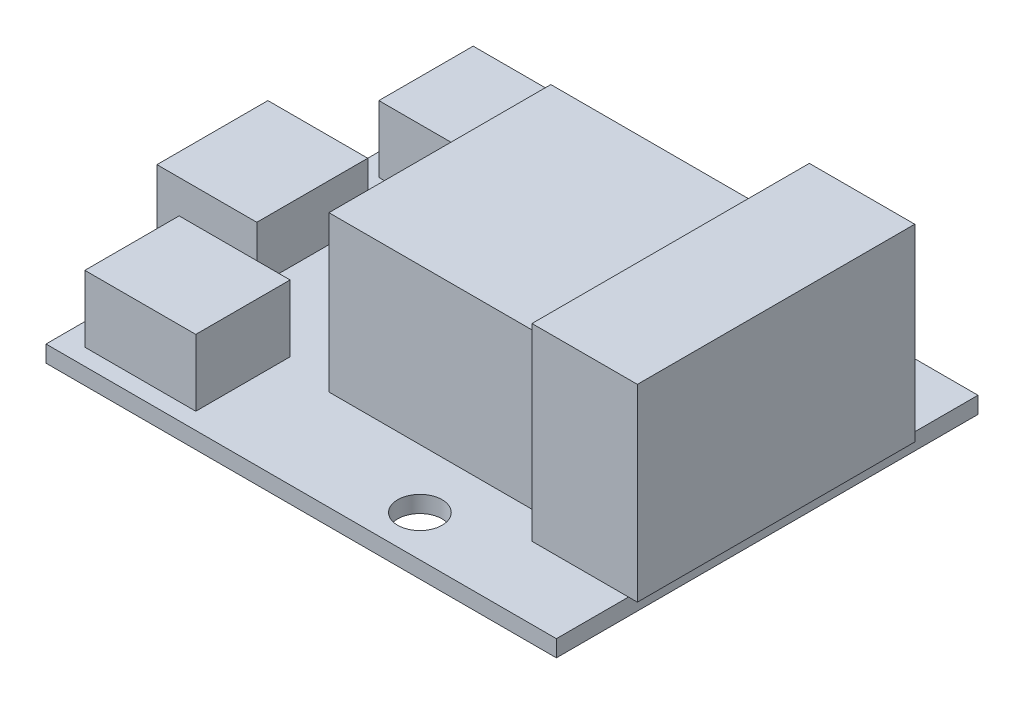
ISO-10303-21;
HEADER;
FILE_DESCRIPTION(('STEP AP214'),'2;1');
FILE_NAME('part.step','',(''),(''),'','','');
FILE_SCHEMA(('AUTOMOTIVE_DESIGN { 1 0 10303 214 1 1 1 1 }'));
ENDSEC;
DATA;
#1=APPLICATION_CONTEXT('core data for automotive mechanical design processes');
#2=APPLICATION_PROTOCOL_DEFINITION('international standard','automotive_design',2000,#1);
#3=PRODUCT_CONTEXT('',#1,'mechanical');
#4=PRODUCT('Part','Part','',(#3));
#5=PRODUCT_RELATED_PRODUCT_CATEGORY('part','',(#4));
#6=PRODUCT_DEFINITION_FORMATION('','',#4);
#7=PRODUCT_DEFINITION_CONTEXT('part definition',#1,'design');
#8=PRODUCT_DEFINITION('design','',#6,#7);
#9=PRODUCT_DEFINITION_SHAPE('','',#8);
#10=(LENGTH_UNIT() NAMED_UNIT(*) SI_UNIT(.MILLI.,.METRE.));
#11=(NAMED_UNIT(*) PLANE_ANGLE_UNIT() SI_UNIT($,.RADIAN.));
#12=(NAMED_UNIT(*) SI_UNIT($,.STERADIAN.) SOLID_ANGLE_UNIT());
#13=UNCERTAINTY_MEASURE_WITH_UNIT(LENGTH_MEASURE(1.E-05),#10,'distance_accuracy_value','');
#14=(GEOMETRIC_REPRESENTATION_CONTEXT(3) GLOBAL_UNCERTAINTY_ASSIGNED_CONTEXT((#13)) GLOBAL_UNIT_ASSIGNED_CONTEXT((#10,
#11,#12)) REPRESENTATION_CONTEXT('',''));
#15=CARTESIAN_POINT('',(0.,0.,0.));
#16=DIRECTION('',(0.,0.,1.));
#17=DIRECTION('',(1.,0.,0.));
#18=AXIS2_PLACEMENT_3D('',#15,#16,#17);
#19=CARTESIAN_POINT('',(0.,1.5,0.));
#20=DIRECTION('',(0.,-1.,0.));
#21=DIRECTION('',(0.,0.,-1.));
#22=AXIS2_PLACEMENT_3D('',#19,#20,#21);
#23=PLANE('',#22);
#24=DIRECTION('',(0.,0.,1.));
#25=VECTOR('',#24,1.);
#26=CARTESIAN_POINT('',(-6.49999999999999,1.5,-10.));
#27=LINE('',#26,#25);
#28=CARTESIAN_POINT('',(-6.49999999999999,1.5,-10.));
#29=VERTEX_POINT('',#28);
#30=CARTESIAN_POINT('',(-6.49999999999999,1.5,10.));
#31=VERTEX_POINT('',#30);
#32=EDGE_CURVE('E258',#29,#31,#27,.T.);
#33=ORIENTED_EDGE('',*,*,#32,.F.);
#34=DIRECTION('',(1.,0.,0.));
#35=VECTOR('',#34,1.);
#36=CARTESIAN_POINT('',(-6.49999999999999,1.5,-10.));
#37=LINE('',#36,#35);
#38=CARTESIAN_POINT('',(13.5,1.5,-10.));
#39=VERTEX_POINT('',#38);
#40=EDGE_CURVE('E271',#29,#39,#37,.T.);
#41=ORIENTED_EDGE('',*,*,#40,.T.);
#42=DIRECTION('',(0.,0.,1.));
#43=VECTOR('',#42,1.);
#44=CARTESIAN_POINT('',(13.5,1.5,-10.));
#45=LINE('',#44,#43);
#46=CARTESIAN_POINT('',(13.5,1.5,10.));
#47=VERTEX_POINT('',#46);
#48=EDGE_CURVE('E282',#39,#47,#45,.T.);
#49=ORIENTED_EDGE('',*,*,#48,.T.);
#50=DIRECTION('',(1.,0.,0.));
#51=VECTOR('',#50,1.);
#52=CARTESIAN_POINT('',(-6.49999999999999,1.5,10.));
#53=LINE('',#52,#51);
#54=EDGE_CURVE('E261',#31,#47,#53,.T.);
#55=ORIENTED_EDGE('',*,*,#54,.F.);
#56=EDGE_LOOP('',(#33,#41,#49,#55));
#57=FACE_BOUND('',#56,.T.);
#58=DIRECTION('',(1.,0.,0.));
#59=VECTOR('',#58,1.);
#60=CARTESIAN_POINT('',(-21.,1.5,-9.));
#61=LINE('',#60,#59);
#62=CARTESIAN_POINT('',(-21.,1.5,-9.));
#63=VERTEX_POINT('',#62);
#64=CARTESIAN_POINT('',(-11.,1.5,-9.));
#65=VERTEX_POINT('',#64);
#66=EDGE_CURVE('E306',#63,#65,#61,.T.);
#67=ORIENTED_EDGE('',*,*,#66,.F.);
#68=DIRECTION('',(0.,0.,-1.));
#69=VECTOR('',#68,1.);
#70=CARTESIAN_POINT('',(-21.,1.5,-9.));
#71=LINE('',#70,#69);
#72=CARTESIAN_POINT('',(-21.,1.5,-17.5));
#73=VERTEX_POINT('',#72);
#74=EDGE_CURVE('E314',#63,#73,#71,.T.);
#75=ORIENTED_EDGE('',*,*,#74,.T.);
#76=DIRECTION('',(1.,0.,0.));
#77=VECTOR('',#76,1.);
#78=CARTESIAN_POINT('',(-21.,1.5,-17.5));
#79=LINE('',#78,#77);
#80=CARTESIAN_POINT('',(-11.,1.5,-17.5));
#81=VERTEX_POINT('',#80);
#82=EDGE_CURVE('E311',#73,#81,#79,.T.);
#83=ORIENTED_EDGE('',*,*,#82,.T.);
#84=DIRECTION('',(0.,0.,-1.));
#85=VECTOR('',#84,1.);
#86=CARTESIAN_POINT('',(-11.,1.5,-9.));
#87=LINE('',#86,#85);
#88=EDGE_CURVE('E308',#65,#81,#87,.T.);
#89=ORIENTED_EDGE('',*,*,#88,.F.);
#90=EDGE_LOOP('',(#67,#75,#83,#89));
#91=FACE_BOUND('',#90,.T.);
#92=CARTESIAN_POINT('',(7.00000000000001,1.5,15.3));
#93=DIRECTION('',(0.,1.,0.));
#94=DIRECTION('',(0.,0.,1.));
#95=AXIS2_PLACEMENT_3D('',#92,#93,#94);
#96=CIRCLE('',#95,2.);
#97=CARTESIAN_POINT('',(7.00000000000001,1.5,17.3));
#98=VERTEX_POINT('',#97);
#99=EDGE_CURVE('E397',#98,#98,#96,.T.);
#100=ORIENTED_EDGE('',*,*,#99,.F.);
#101=EDGE_LOOP('',(#100));
#102=FACE_BOUND('',#101,.T.);
#103=CARTESIAN_POINT('',(7.00000000000001,1.5,-15.3));
#104=DIRECTION('',(0.,1.,0.));
#105=DIRECTION('',(0.,0.,1.));
#106=AXIS2_PLACEMENT_3D('',#103,#104,#105);
#107=CIRCLE('',#106,2.);
#108=CARTESIAN_POINT('',(7.00000000000001,1.5,-13.3));
#109=VERTEX_POINT('',#108);
#110=EDGE_CURVE('E391',#109,#109,#107,.T.);
#111=ORIENTED_EDGE('',*,*,#110,.F.);
#112=EDGE_LOOP('',(#111));
#113=FACE_BOUND('',#112,.T.);
#114=DIRECTION('',(0.,0.,1.));
#115=VECTOR('',#114,1.);
#116=CARTESIAN_POINT('',(-21.,1.5,9.));
#117=LINE('',#116,#115);
#118=CARTESIAN_POINT('',(-21.,1.5,9.));
#119=VERTEX_POINT('',#118);
#120=CARTESIAN_POINT('',(-21.,1.5,17.5));
#121=VERTEX_POINT('',#120);
#122=EDGE_CURVE('E317',#119,#121,#117,.T.);
#123=ORIENTED_EDGE('',*,*,#122,.F.);
#124=DIRECTION('',(1.,0.,0.));
#125=VECTOR('',#124,1.);
#126=CARTESIAN_POINT('',(-21.,1.5,9.));
#127=LINE('',#126,#125);
#128=CARTESIAN_POINT('',(-11.,1.5,9.));
#129=VERTEX_POINT('',#128);
#130=EDGE_CURVE('E330',#119,#129,#127,.T.);
#131=ORIENTED_EDGE('',*,*,#130,.T.);
#132=DIRECTION('',(0.,0.,1.));
#133=VECTOR('',#132,1.);
#134=CARTESIAN_POINT('',(-11.,1.5,9.));
#135=LINE('',#134,#133);
#136=CARTESIAN_POINT('',(-11.,1.5,17.5));
#137=VERTEX_POINT('',#136);
#138=EDGE_CURVE('E344',#129,#137,#135,.T.);
#139=ORIENTED_EDGE('',*,*,#138,.T.);
#140=DIRECTION('',(1.,0.,0.));
#141=VECTOR('',#140,1.);
#142=CARTESIAN_POINT('',(-21.,1.5,17.5));
#143=LINE('',#142,#141);
#144=EDGE_CURVE('E341',#121,#137,#143,.T.);
#145=ORIENTED_EDGE('',*,*,#144,.F.);
#146=EDGE_LOOP('',(#123,#131,#139,#145));
#147=FACE_BOUND('',#146,.T.);
#148=DIRECTION('',(1.,0.,0.));
#149=VECTOR('',#148,1.);
#150=CARTESIAN_POINT('',(14.3,1.5,12.5));
#151=LINE('',#150,#149);
#152=CARTESIAN_POINT('',(14.3,1.5,12.5));
#153=VERTEX_POINT('',#152);
#154=CARTESIAN_POINT('',(23.,1.5,12.5));
#155=VERTEX_POINT('',#154);
#156=EDGE_CURVE('E79',#153,#155,#151,.T.);
#157=ORIENTED_EDGE('',*,*,#156,.F.);
#158=DIRECTION('',(0.,0.,1.));
#159=VECTOR('',#158,1.);
#160=CARTESIAN_POINT('',(14.3,1.5,-12.5));
#161=LINE('',#160,#159);
#162=CARTESIAN_POINT('',(14.3,1.5,-12.5));
#163=VERTEX_POINT('',#162);
#164=EDGE_CURVE('E84',#163,#153,#161,.T.);
#165=ORIENTED_EDGE('',*,*,#164,.F.);
#166=DIRECTION('',(1.,0.,0.));
#167=VECTOR('',#166,1.);
#168=CARTESIAN_POINT('',(14.3,1.5,-12.5));
#169=LINE('',#168,#167);
#170=CARTESIAN_POINT('',(23.,1.5,-12.5));
#171=VERTEX_POINT('',#170);
#172=EDGE_CURVE('E255',#163,#171,#169,.T.);
#173=ORIENTED_EDGE('',*,*,#172,.T.);
#174=DIRECTION('',(0.,0.,-1.));
#175=VECTOR('',#174,1.);
#176=CARTESIAN_POINT('',(23.,1.5,19.));
#177=LINE('',#176,#175);
#178=CARTESIAN_POINT('',(23.,1.5,-19.));
#179=VERTEX_POINT('',#178);
#180=EDGE_CURVE('E407',#171,#179,#177,.T.);
#181=ORIENTED_EDGE('',*,*,#180,.T.);
#182=DIRECTION('',(-1.,0.,0.));
#183=VECTOR('',#182,1.);
#184=CARTESIAN_POINT('',(-23.,1.5,-19.));
#185=LINE('',#184,#183);
#186=CARTESIAN_POINT('',(-23.,1.5,-19.));
#187=VERTEX_POINT('',#186);
#188=EDGE_CURVE('E405',#179,#187,#185,.T.);
#189=ORIENTED_EDGE('',*,*,#188,.T.);
#190=DIRECTION('',(0.,0.,1.));
#191=VECTOR('',#190,1.);
#192=CARTESIAN_POINT('',(-23.,1.5,19.));
#193=LINE('',#192,#191);
#194=CARTESIAN_POINT('',(-23.,1.5,-5.));
#195=VERTEX_POINT('',#194);
#196=EDGE_CURVE('E410',#187,#195,#193,.T.);
#197=ORIENTED_EDGE('',*,*,#196,.T.);
#198=DIRECTION('',(1.,0.,0.));
#199=VECTOR('',#198,1.);
#200=CARTESIAN_POINT('',(0.,1.5,-5.));
#201=LINE('',#200,#199);
#202=CARTESIAN_POINT('',(-18.,1.5,-5.));
#203=VERTEX_POINT('',#202);
#204=EDGE_CURVE('E70',#195,#203,#201,.T.);
#205=ORIENTED_EDGE('',*,*,#204,.T.);
#206=DIRECTION('',(0.,0.,1.));
#207=VECTOR('',#206,1.);
#208=CARTESIAN_POINT('',(-18.,1.5,0.));
#209=LINE('',#208,#207);
#210=CARTESIAN_POINT('',(-18.,1.5,5.));
#211=VERTEX_POINT('',#210);
#212=EDGE_CURVE('E367',#203,#211,#209,.T.);
#213=ORIENTED_EDGE('',*,*,#212,.T.);
#214=DIRECTION('',(1.,0.,0.));
#215=VECTOR('',#214,1.);
#216=CARTESIAN_POINT('',(0.,1.5,5.));
#217=LINE('',#216,#215);
#218=CARTESIAN_POINT('',(-23.,1.5,5.));
#219=VERTEX_POINT('',#218);
#220=EDGE_CURVE('E12',#219,#211,#217,.T.);
#221=ORIENTED_EDGE('',*,*,#220,.F.);
#222=CARTESIAN_POINT('',(-23.,1.5,19.));
#223=VERTEX_POINT('',#222);
#224=EDGE_CURVE('E409',#219,#223,#193,.T.);
#225=ORIENTED_EDGE('',*,*,#224,.T.);
#226=DIRECTION('',(1.,0.,0.));
#227=VECTOR('',#226,1.);
#228=CARTESIAN_POINT('',(-23.,1.5,19.));
#229=LINE('',#228,#227);
#230=CARTESIAN_POINT('',(23.,1.5,19.));
#231=VERTEX_POINT('',#230);
#232=EDGE_CURVE('E413',#223,#231,#229,.T.);
#233=ORIENTED_EDGE('',*,*,#232,.T.);
#234=EDGE_CURVE('E403',#231,#155,#177,.T.);
#235=ORIENTED_EDGE('',*,*,#234,.T.);
#236=EDGE_LOOP('',(#157,#165,#173,#181,#189,#197,#205,#213,#221,#225,#233,#235));
#237=FACE_BOUND('',#236,.T.);
#238=ADVANCED_FACE('F61',(#57,#91,#102,#113,#147,#237),#23,.F.);
#239=CARTESIAN_POINT('',(0.,0.,0.));
#240=DIRECTION('',(0.,-1.,0.));
#241=DIRECTION('',(0.,0.,-1.));
#242=AXIS2_PLACEMENT_3D('',#239,#240,#241);
#243=PLANE('',#242);
#244=CARTESIAN_POINT('',(7.00000000000001,0.,15.3));
#245=DIRECTION('',(0.,1.,0.));
#246=DIRECTION('',(0.,0.,1.));
#247=AXIS2_PLACEMENT_3D('',#244,#245,#246);
#248=CIRCLE('',#247,2.);
#249=CARTESIAN_POINT('',(7.00000000000001,0.,17.3));
#250=VERTEX_POINT('',#249);
#251=EDGE_CURVE('E394',#250,#250,#248,.T.);
#252=ORIENTED_EDGE('',*,*,#251,.T.);
#253=EDGE_LOOP('',(#252));
#254=FACE_BOUND('',#253,.T.);
#255=DIRECTION('',(0.,0.,-1.));
#256=VECTOR('',#255,1.);
#257=CARTESIAN_POINT('',(23.,0.,19.));
#258=LINE('',#257,#256);
#259=CARTESIAN_POINT('',(23.,0.,19.));
#260=VERTEX_POINT('',#259);
#261=CARTESIAN_POINT('',(23.,0.,-19.));
#262=VERTEX_POINT('',#261);
#263=EDGE_CURVE('E400',#260,#262,#258,.T.);
#264=ORIENTED_EDGE('',*,*,#263,.F.);
#265=DIRECTION('',(1.,0.,0.));
#266=VECTOR('',#265,1.);
#267=CARTESIAN_POINT('',(-23.,0.,19.));
#268=LINE('',#267,#266);
#269=CARTESIAN_POINT('',(-23.,0.,19.));
#270=VERTEX_POINT('',#269);
#271=EDGE_CURVE('E423',#270,#260,#268,.T.);
#272=ORIENTED_EDGE('',*,*,#271,.F.);
#273=DIRECTION('',(0.,0.,1.));
#274=VECTOR('',#273,1.);
#275=CARTESIAN_POINT('',(-23.,0.,19.));
#276=LINE('',#275,#274);
#277=CARTESIAN_POINT('',(-23.,0.,-19.));
#278=VERTEX_POINT('',#277);
#279=EDGE_CURVE('E421',#278,#270,#276,.T.);
#280=ORIENTED_EDGE('',*,*,#279,.F.);
#281=DIRECTION('',(-1.,0.,0.));
#282=VECTOR('',#281,1.);
#283=CARTESIAN_POINT('',(-23.,0.,-19.));
#284=LINE('',#283,#282);
#285=EDGE_CURVE('E419',#262,#278,#284,.T.);
#286=ORIENTED_EDGE('',*,*,#285,.F.);
#287=EDGE_LOOP('',(#264,#272,#280,#286));
#288=FACE_BOUND('',#287,.T.);
#289=CARTESIAN_POINT('',(7.00000000000001,0.,-15.3));
#290=DIRECTION('',(0.,1.,0.));
#291=DIRECTION('',(0.,0.,1.));
#292=AXIS2_PLACEMENT_3D('',#289,#290,#291);
#293=CIRCLE('',#292,2.);
#294=CARTESIAN_POINT('',(7.00000000000001,0.,-13.3));
#295=VERTEX_POINT('',#294);
#296=EDGE_CURVE('E380',#295,#295,#293,.T.);
#297=ORIENTED_EDGE('',*,*,#296,.T.);
#298=EDGE_LOOP('',(#297));
#299=FACE_BOUND('',#298,.T.);
#300=ADVANCED_FACE('F492',(#254,#288,#299),#243,.T.);
#301=CARTESIAN_POINT('',(23.,1.5,19.));
#302=DIRECTION('',(-1.,0.,0.));
#303=DIRECTION('',(0.,0.,1.));
#304=AXIS2_PLACEMENT_3D('',#301,#302,#303);
#305=PLANE('',#304);
#306=ORIENTED_EDGE('',*,*,#263,.T.);
#307=DIRECTION('',(0.,-1.,0.));
#308=VECTOR('',#307,1.);
#309=CARTESIAN_POINT('',(23.,1.5,-19.));
#310=LINE('',#309,#308);
#311=EDGE_CURVE('E65',#179,#262,#310,.T.);
#312=ORIENTED_EDGE('',*,*,#311,.F.);
#313=ORIENTED_EDGE('',*,*,#180,.F.);
#314=EDGE_CURVE('E406',#155,#171,#177,.T.);
#315=ORIENTED_EDGE('',*,*,#314,.F.);
#316=ORIENTED_EDGE('',*,*,#234,.F.);
#317=DIRECTION('',(0.,-1.,0.));
#318=VECTOR('',#317,1.);
#319=CARTESIAN_POINT('',(23.,1.5,19.));
#320=LINE('',#319,#318);
#321=EDGE_CURVE('E416',#231,#260,#320,.T.);
#322=ORIENTED_EDGE('',*,*,#321,.T.);
#323=EDGE_LOOP('',(#306,#312,#313,#315,#316,#322));
#324=FACE_BOUND('',#323,.T.);
#325=ADVANCED_FACE('F63',(#324),#305,.F.);
#326=CARTESIAN_POINT('',(-23.,1.5,-19.));
#327=DIRECTION('',(0.,0.,1.));
#328=DIRECTION('',(1.,0.,0.));
#329=AXIS2_PLACEMENT_3D('',#326,#327,#328);
#330=PLANE('',#329);
#331=ORIENTED_EDGE('',*,*,#285,.T.);
#332=DIRECTION('',(0.,-1.,0.));
#333=VECTOR('',#332,1.);
#334=CARTESIAN_POINT('',(-23.,1.5,-19.));
#335=LINE('',#334,#333);
#336=EDGE_CURVE('E429',#187,#278,#335,.T.);
#337=ORIENTED_EDGE('',*,*,#336,.F.);
#338=ORIENTED_EDGE('',*,*,#188,.F.);
#339=ORIENTED_EDGE('',*,*,#311,.T.);
#340=EDGE_LOOP('',(#331,#337,#338,#339));
#341=FACE_BOUND('',#340,.T.);
#342=ADVANCED_FACE('F509',(#341),#330,.F.);
#343=CARTESIAN_POINT('',(-23.,1.5,19.));
#344=DIRECTION('',(1.,0.,0.));
#345=DIRECTION('',(0.,0.,-1.));
#346=AXIS2_PLACEMENT_3D('',#343,#344,#345);
#347=PLANE('',#346);
#348=ORIENTED_EDGE('',*,*,#279,.T.);
#349=DIRECTION('',(0.,-1.,0.));
#350=VECTOR('',#349,1.);
#351=CARTESIAN_POINT('',(-23.,1.5,19.));
#352=LINE('',#351,#350);
#353=EDGE_CURVE('E427',#223,#270,#352,.T.);
#354=ORIENTED_EDGE('',*,*,#353,.F.);
#355=ORIENTED_EDGE('',*,*,#224,.F.);
#356=EDGE_CURVE('E414',#195,#219,#193,.T.);
#357=ORIENTED_EDGE('',*,*,#356,.F.);
#358=ORIENTED_EDGE('',*,*,#196,.F.);
#359=ORIENTED_EDGE('',*,*,#336,.T.);
#360=EDGE_LOOP('',(#348,#354,#355,#357,#358,#359));
#361=FACE_BOUND('',#360,.T.);
#362=ADVANCED_FACE('F449',(#361),#347,.F.);
#363=CARTESIAN_POINT('',(-23.,1.5,19.));
#364=DIRECTION('',(0.,0.,-1.));
#365=DIRECTION('',(-1.,0.,0.));
#366=AXIS2_PLACEMENT_3D('',#363,#364,#365);
#367=PLANE('',#366);
#368=ORIENTED_EDGE('',*,*,#271,.T.);
#369=ORIENTED_EDGE('',*,*,#321,.F.);
#370=ORIENTED_EDGE('',*,*,#232,.F.);
#371=ORIENTED_EDGE('',*,*,#353,.T.);
#372=EDGE_LOOP('',(#368,#369,#370,#371));
#373=FACE_BOUND('',#372,.T.);
#374=ADVANCED_FACE('F455',(#373),#367,.F.);
#375=CARTESIAN_POINT('',(7.00000000000001,1.5,15.3));
#376=DIRECTION('',(0.,-1.,0.));
#377=DIRECTION('',(0.,0.,-1.));
#378=AXIS2_PLACEMENT_3D('',#375,#376,#377);
#379=CYLINDRICAL_SURFACE('',#378,2.);
#380=ORIENTED_EDGE('',*,*,#99,.T.);
#381=EDGE_LOOP('',(#380));
#382=FACE_BOUND('',#381,.T.);
#383=ORIENTED_EDGE('',*,*,#251,.F.);
#384=EDGE_LOOP('',(#383));
#385=FACE_BOUND('',#384,.T.);
#386=ADVANCED_FACE('F503',(#382,#385),#379,.F.);
#387=CARTESIAN_POINT('',(7.00000000000001,1.5,-15.3));
#388=DIRECTION('',(0.,-1.,0.));
#389=DIRECTION('',(0.,0.,-1.));
#390=AXIS2_PLACEMENT_3D('',#387,#388,#389);
#391=CYLINDRICAL_SURFACE('',#390,2.);
#392=ORIENTED_EDGE('',*,*,#110,.T.);
#393=EDGE_LOOP('',(#392));
#394=FACE_BOUND('',#393,.T.);
#395=ORIENTED_EDGE('',*,*,#296,.F.);
#396=EDGE_LOOP('',(#395));
#397=FACE_BOUND('',#396,.T.);
#398=ADVANCED_FACE('F518',(#394,#397),#391,.F.);
#399=CARTESIAN_POINT('',(0.,1.5,0.));
#400=DIRECTION('',(0.,1.,0.));
#401=DIRECTION('',(0.,0.,1.));
#402=AXIS2_PLACEMENT_3D('',#399,#400,#401);
#403=PLANE('',#402);
#404=CARTESIAN_POINT('',(-27.,1.5,-5.));
#405=VERTEX_POINT('',#404);
#406=EDGE_CURVE('E370',#405,#195,#201,.T.);
#407=ORIENTED_EDGE('',*,*,#406,.T.);
#408=ORIENTED_EDGE('',*,*,#356,.T.);
#409=CARTESIAN_POINT('',(-27.,1.5,5.));
#410=VERTEX_POINT('',#409);
#411=EDGE_CURVE('E72',#410,#219,#217,.T.);
#412=ORIENTED_EDGE('',*,*,#411,.F.);
#413=DIRECTION('',(0.,0.,1.));
#414=VECTOR('',#413,1.);
#415=CARTESIAN_POINT('',(-27.,1.5,-5.));
#416=LINE('',#415,#414);
#417=EDGE_CURVE('E357',#405,#410,#416,.T.);
#418=ORIENTED_EDGE('',*,*,#417,.F.);
#419=EDGE_LOOP('',(#407,#408,#412,#418));
#420=FACE_BOUND('',#419,.T.);
#421=ADVANCED_FACE('F447',(#420),#403,.F.);
#422=CARTESIAN_POINT('',(-18.,6.5,0.));
#423=DIRECTION('',(1.,0.,0.));
#424=DIRECTION('',(0.,0.,-1.));
#425=AXIS2_PLACEMENT_3D('',#422,#423,#424);
#426=PLANE('',#425);
#427=ORIENTED_EDGE('',*,*,#212,.F.);
#428=DIRECTION('',(0.,-1.,0.));
#429=VECTOR('',#428,1.);
#430=CARTESIAN_POINT('',(-18.,6.5,-5.));
#431=LINE('',#430,#429);
#432=CARTESIAN_POINT('',(-18.,6.5,-5.));
#433=VERTEX_POINT('',#432);
#434=EDGE_CURVE('E377',#433,#203,#431,.T.);
#435=ORIENTED_EDGE('',*,*,#434,.F.);
#436=DIRECTION('',(0.,0.,1.));
#437=VECTOR('',#436,1.);
#438=CARTESIAN_POINT('',(-18.,6.5,0.));
#439=LINE('',#438,#437);
#440=CARTESIAN_POINT('',(-18.,6.5,5.));
#441=VERTEX_POINT('',#440);
#442=EDGE_CURVE('E358',#433,#441,#439,.T.);
#443=ORIENTED_EDGE('',*,*,#442,.T.);
#444=DIRECTION('',(0.,-1.,0.));
#445=VECTOR('',#444,1.);
#446=CARTESIAN_POINT('',(-18.,6.5,5.));
#447=LINE('',#446,#445);
#448=EDGE_CURVE('E366',#441,#211,#447,.T.);
#449=ORIENTED_EDGE('',*,*,#448,.T.);
#450=EDGE_LOOP('',(#427,#435,#443,#449));
#451=FACE_BOUND('',#450,.T.);
#452=ADVANCED_FACE('F525',(#451),#426,.T.);
#453=CARTESIAN_POINT('',(0.,6.5,5.));
#454=DIRECTION('',(0.,0.,-1.));
#455=DIRECTION('',(-1.,0.,0.));
#456=AXIS2_PLACEMENT_3D('',#453,#454,#455);
#457=PLANE('',#456);
#458=ORIENTED_EDGE('',*,*,#411,.T.);
#459=ORIENTED_EDGE('',*,*,#220,.T.);
#460=ORIENTED_EDGE('',*,*,#448,.F.);
#461=DIRECTION('',(1.,0.,0.));
#462=VECTOR('',#461,1.);
#463=CARTESIAN_POINT('',(0.,6.5,5.));
#464=LINE('',#463,#462);
#465=CARTESIAN_POINT('',(-27.,6.5,5.));
#466=VERTEX_POINT('',#465);
#467=EDGE_CURVE('E364',#466,#441,#464,.T.);
#468=ORIENTED_EDGE('',*,*,#467,.F.);
#469=DIRECTION('',(0.,-1.,0.));
#470=VECTOR('',#469,1.);
#471=CARTESIAN_POINT('',(-27.,6.5,5.));
#472=LINE('',#471,#470);
#473=EDGE_CURVE('E384',#466,#410,#472,.T.);
#474=ORIENTED_EDGE('',*,*,#473,.T.);
#475=EDGE_LOOP('',(#458,#459,#460,#468,#474));
#476=FACE_BOUND('',#475,.T.);
#477=ADVANCED_FACE('F537',(#476),#457,.F.);
#478=CARTESIAN_POINT('',(0.,6.5,-5.));
#479=DIRECTION('',(0.,0.,-1.));
#480=DIRECTION('',(-1.,0.,0.));
#481=AXIS2_PLACEMENT_3D('',#478,#479,#480);
#482=PLANE('',#481);
#483=ORIENTED_EDGE('',*,*,#406,.F.);
#484=DIRECTION('',(0.,-1.,0.));
#485=VECTOR('',#484,1.);
#486=CARTESIAN_POINT('',(-27.,6.5,-5.));
#487=LINE('',#486,#485);
#488=CARTESIAN_POINT('',(-27.,6.5,-5.));
#489=VERTEX_POINT('',#488);
#490=EDGE_CURVE('E371',#489,#405,#487,.T.);
#491=ORIENTED_EDGE('',*,*,#490,.F.);
#492=DIRECTION('',(1.,0.,0.));
#493=VECTOR('',#492,1.);
#494=CARTESIAN_POINT('',(0.,6.5,-5.));
#495=LINE('',#494,#493);
#496=EDGE_CURVE('E361',#489,#433,#495,.T.);
#497=ORIENTED_EDGE('',*,*,#496,.T.);
#498=ORIENTED_EDGE('',*,*,#434,.T.);
#499=ORIENTED_EDGE('',*,*,#204,.F.);
#500=EDGE_LOOP('',(#483,#491,#497,#498,#499));
#501=FACE_BOUND('',#500,.T.);
#502=ADVANCED_FACE('F442',(#501),#482,.T.);
#503=CARTESIAN_POINT('',(0.,6.5,0.));
#504=DIRECTION('',(0.,1.,0.));
#505=DIRECTION('',(0.,0.,1.));
#506=AXIS2_PLACEMENT_3D('',#503,#504,#505);
#507=PLANE('',#506);
#508=ORIENTED_EDGE('',*,*,#442,.F.);
#509=ORIENTED_EDGE('',*,*,#496,.F.);
#510=DIRECTION('',(0.,0.,1.));
#511=VECTOR('',#510,1.);
#512=CARTESIAN_POINT('',(-27.,6.5,-5.));
#513=LINE('',#512,#511);
#514=EDGE_CURVE('E381',#489,#466,#513,.T.);
#515=ORIENTED_EDGE('',*,*,#514,.T.);
#516=ORIENTED_EDGE('',*,*,#467,.T.);
#517=EDGE_LOOP('',(#508,#509,#515,#516));
#518=FACE_BOUND('',#517,.T.);
#519=ADVANCED_FACE('F533',(#518),#507,.T.);
#520=CARTESIAN_POINT('',(-27.,6.5,-5.));
#521=DIRECTION('',(1.,0.,0.));
#522=DIRECTION('',(0.,0.,-1.));
#523=AXIS2_PLACEMENT_3D('',#520,#521,#522);
#524=PLANE('',#523);
#525=ORIENTED_EDGE('',*,*,#417,.T.);
#526=ORIENTED_EDGE('',*,*,#473,.F.);
#527=ORIENTED_EDGE('',*,*,#514,.F.);
#528=ORIENTED_EDGE('',*,*,#490,.T.);
#529=EDGE_LOOP('',(#525,#526,#527,#528));
#530=FACE_BOUND('',#529,.T.);
#531=ADVANCED_FACE('F529',(#530),#524,.F.);
#532=CARTESIAN_POINT('',(-21.,7.5,9.));
#533=DIRECTION('',(1.,0.,0.));
#534=DIRECTION('',(0.,0.,-1.));
#535=AXIS2_PLACEMENT_3D('',#532,#533,#534);
#536=PLANE('',#535);
#537=ORIENTED_EDGE('',*,*,#122,.T.);
#538=DIRECTION('',(0.,-1.,0.));
#539=VECTOR('',#538,1.);
#540=CARTESIAN_POINT('',(-21.,7.5,17.5));
#541=LINE('',#540,#539);
#542=CARTESIAN_POINT('',(-21.,7.5,17.5));
#543=VERTEX_POINT('',#542);
#544=EDGE_CURVE('E355',#543,#121,#541,.T.);
#545=ORIENTED_EDGE('',*,*,#544,.F.);
#546=DIRECTION('',(0.,0.,1.));
#547=VECTOR('',#546,1.);
#548=CARTESIAN_POINT('',(-21.,7.5,9.));
#549=LINE('',#548,#547);
#550=CARTESIAN_POINT('',(-21.,7.5,9.));
#551=VERTEX_POINT('',#550);
#552=EDGE_CURVE('E326',#551,#543,#549,.T.);
#553=ORIENTED_EDGE('',*,*,#552,.F.);
#554=DIRECTION('',(0.,-1.,0.));
#555=VECTOR('',#554,1.);
#556=CARTESIAN_POINT('',(-21.,7.5,9.));
#557=LINE('',#556,#555);
#558=EDGE_CURVE('E338',#551,#119,#557,.T.);
#559=ORIENTED_EDGE('',*,*,#558,.T.);
#560=EDGE_LOOP('',(#537,#545,#553,#559));
#561=FACE_BOUND('',#560,.T.);
#562=ADVANCED_FACE('F532',(#561),#536,.F.);
#563=CARTESIAN_POINT('',(-21.,7.5,17.5));
#564=DIRECTION('',(0.,0.,-1.));
#565=DIRECTION('',(-1.,0.,0.));
#566=AXIS2_PLACEMENT_3D('',#563,#564,#565);
#567=PLANE('',#566);
#568=ORIENTED_EDGE('',*,*,#144,.T.);
#569=DIRECTION('',(0.,-1.,0.));
#570=VECTOR('',#569,1.);
#571=CARTESIAN_POINT('',(-11.,7.5,17.5));
#572=LINE('',#571,#570);
#573=CARTESIAN_POINT('',(-11.,7.5,17.5));
#574=VERTEX_POINT('',#573);
#575=EDGE_CURVE('E353',#574,#137,#572,.T.);
#576=ORIENTED_EDGE('',*,*,#575,.F.);
#577=DIRECTION('',(1.,0.,0.));
#578=VECTOR('',#577,1.);
#579=CARTESIAN_POINT('',(-21.,7.5,17.5));
#580=LINE('',#579,#578);
#581=EDGE_CURVE('E329',#543,#574,#580,.T.);
#582=ORIENTED_EDGE('',*,*,#581,.F.);
#583=ORIENTED_EDGE('',*,*,#544,.T.);
#584=EDGE_LOOP('',(#568,#576,#582,#583));
#585=FACE_BOUND('',#584,.T.);
#586=ADVANCED_FACE('F549',(#585),#567,.F.);
#587=CARTESIAN_POINT('',(-11.,7.5,9.));
#588=DIRECTION('',(1.,0.,0.));
#589=DIRECTION('',(0.,0.,-1.));
#590=AXIS2_PLACEMENT_3D('',#587,#588,#589);
#591=PLANE('',#590);
#592=ORIENTED_EDGE('',*,*,#138,.F.);
#593=DIRECTION('',(0.,-1.,0.));
#594=VECTOR('',#593,1.);
#595=CARTESIAN_POINT('',(-11.,7.5,9.));
#596=LINE('',#595,#594);
#597=CARTESIAN_POINT('',(-11.,7.5,9.));
#598=VERTEX_POINT('',#597);
#599=EDGE_CURVE('E350',#598,#129,#596,.T.);
#600=ORIENTED_EDGE('',*,*,#599,.F.);
#601=DIRECTION('',(0.,0.,1.));
#602=VECTOR('',#601,1.);
#603=CARTESIAN_POINT('',(-11.,7.5,9.));
#604=LINE('',#603,#602);
#605=EDGE_CURVE('E332',#598,#574,#604,.T.);
#606=ORIENTED_EDGE('',*,*,#605,.T.);
#607=ORIENTED_EDGE('',*,*,#575,.T.);
#608=EDGE_LOOP('',(#592,#600,#606,#607));
#609=FACE_BOUND('',#608,.T.);
#610=ADVANCED_FACE('F553',(#609),#591,.T.);
#611=CARTESIAN_POINT('',(-21.,7.5,9.));
#612=DIRECTION('',(0.,0.,-1.));
#613=DIRECTION('',(-1.,0.,0.));
#614=AXIS2_PLACEMENT_3D('',#611,#612,#613);
#615=PLANE('',#614);
#616=ORIENTED_EDGE('',*,*,#130,.F.);
#617=ORIENTED_EDGE('',*,*,#558,.F.);
#618=DIRECTION('',(1.,0.,0.));
#619=VECTOR('',#618,1.);
#620=CARTESIAN_POINT('',(-21.,7.5,9.));
#621=LINE('',#620,#619);
#622=EDGE_CURVE('E335',#551,#598,#621,.T.);
#623=ORIENTED_EDGE('',*,*,#622,.T.);
#624=ORIENTED_EDGE('',*,*,#599,.T.);
#625=EDGE_LOOP('',(#616,#617,#623,#624));
#626=FACE_BOUND('',#625,.T.);
#627=ADVANCED_FACE('F557',(#626),#615,.T.);
#628=CARTESIAN_POINT('',(0.,7.5,0.));
#629=DIRECTION('',(0.,1.,0.));
#630=DIRECTION('',(0.,0.,1.));
#631=AXIS2_PLACEMENT_3D('',#628,#629,#630);
#632=PLANE('',#631);
#633=ORIENTED_EDGE('',*,*,#552,.T.);
#634=ORIENTED_EDGE('',*,*,#581,.T.);
#635=ORIENTED_EDGE('',*,*,#605,.F.);
#636=ORIENTED_EDGE('',*,*,#622,.F.);
#637=EDGE_LOOP('',(#633,#634,#635,#636));
#638=FACE_BOUND('',#637,.T.);
#639=ADVANCED_FACE('F561',(#638),#632,.T.);
#640=CARTESIAN_POINT('',(-21.,7.5,-9.));
#641=DIRECTION('',(-1.,0.,0.));
#642=DIRECTION('',(0.,0.,1.));
#643=AXIS2_PLACEMENT_3D('',#640,#641,#642);
#644=PLANE('',#643);
#645=ORIENTED_EDGE('',*,*,#74,.F.);
#646=DIRECTION('',(0.,-1.,0.));
#647=VECTOR('',#646,1.);
#648=CARTESIAN_POINT('',(-21.,7.5,-9.));
#649=LINE('',#648,#647);
#650=CARTESIAN_POINT('',(-21.,7.5,-9.));
#651=VERTEX_POINT('',#650);
#652=EDGE_CURVE('E295',#651,#63,#649,.T.);
#653=ORIENTED_EDGE('',*,*,#652,.F.);
#654=DIRECTION('',(0.,0.,-1.));
#655=VECTOR('',#654,1.);
#656=CARTESIAN_POINT('',(-21.,7.5,-9.));
#657=LINE('',#656,#655);
#658=CARTESIAN_POINT('',(-21.,7.5,-17.5));
#659=VERTEX_POINT('',#658);
#660=EDGE_CURVE('E309',#651,#659,#657,.T.);
#661=ORIENTED_EDGE('',*,*,#660,.T.);
#662=DIRECTION('',(0.,-1.,0.));
#663=VECTOR('',#662,1.);
#664=CARTESIAN_POINT('',(-21.,7.5,-17.5));
#665=LINE('',#664,#663);
#666=EDGE_CURVE('E296',#659,#73,#665,.T.);
#667=ORIENTED_EDGE('',*,*,#666,.T.);
#668=EDGE_LOOP('',(#645,#653,#661,#667));
#669=FACE_BOUND('',#668,.T.);
#670=ADVANCED_FACE('F565',(#669),#644,.T.);
#671=CARTESIAN_POINT('',(-21.,7.5,-9.));
#672=DIRECTION('',(0.,0.,-1.));
#673=DIRECTION('',(-1.,0.,0.));
#674=AXIS2_PLACEMENT_3D('',#671,#672,#673);
#675=PLANE('',#674);
#676=ORIENTED_EDGE('',*,*,#66,.T.);
#677=DIRECTION('',(0.,-1.,0.));
#678=VECTOR('',#677,1.);
#679=CARTESIAN_POINT('',(-11.,7.5,-9.));
#680=LINE('',#679,#678);
#681=CARTESIAN_POINT('',(-11.,7.5,-9.));
#682=VERTEX_POINT('',#681);
#683=EDGE_CURVE('E302',#682,#65,#680,.T.);
#684=ORIENTED_EDGE('',*,*,#683,.F.);
#685=DIRECTION('',(1.,0.,0.));
#686=VECTOR('',#685,1.);
#687=CARTESIAN_POINT('',(-21.,7.5,-9.));
#688=LINE('',#687,#686);
#689=EDGE_CURVE('E298',#651,#682,#688,.T.);
#690=ORIENTED_EDGE('',*,*,#689,.F.);
#691=ORIENTED_EDGE('',*,*,#652,.T.);
#692=EDGE_LOOP('',(#676,#684,#690,#691));
#693=FACE_BOUND('',#692,.T.);
#694=ADVANCED_FACE('F573',(#693),#675,.F.);
#695=CARTESIAN_POINT('',(-11.,7.5,-9.));
#696=DIRECTION('',(-1.,0.,0.));
#697=DIRECTION('',(0.,0.,1.));
#698=AXIS2_PLACEMENT_3D('',#695,#696,#697);
#699=PLANE('',#698);
#700=ORIENTED_EDGE('',*,*,#88,.T.);
#701=DIRECTION('',(0.,-1.,0.));
#702=VECTOR('',#701,1.);
#703=CARTESIAN_POINT('',(-11.,7.5,-17.5));
#704=LINE('',#703,#702);
#705=CARTESIAN_POINT('',(-11.,7.5,-17.5));
#706=VERTEX_POINT('',#705);
#707=EDGE_CURVE('E299',#706,#81,#704,.T.);
#708=ORIENTED_EDGE('',*,*,#707,.F.);
#709=DIRECTION('',(0.,0.,-1.));
#710=VECTOR('',#709,1.);
#711=CARTESIAN_POINT('',(-11.,7.5,-9.));
#712=LINE('',#711,#710);
#713=EDGE_CURVE('E319',#682,#706,#712,.T.);
#714=ORIENTED_EDGE('',*,*,#713,.F.);
#715=ORIENTED_EDGE('',*,*,#683,.T.);
#716=EDGE_LOOP('',(#700,#708,#714,#715));
#717=FACE_BOUND('',#716,.T.);
#718=ADVANCED_FACE('F576',(#717),#699,.F.);
#719=CARTESIAN_POINT('',(-21.,7.5,-17.5));
#720=DIRECTION('',(0.,0.,-1.));
#721=DIRECTION('',(-1.,0.,0.));
#722=AXIS2_PLACEMENT_3D('',#719,#720,#721);
#723=PLANE('',#722);
#724=ORIENTED_EDGE('',*,*,#82,.F.);
#725=ORIENTED_EDGE('',*,*,#666,.F.);
#726=DIRECTION('',(1.,0.,0.));
#727=VECTOR('',#726,1.);
#728=CARTESIAN_POINT('',(-21.,7.5,-17.5));
#729=LINE('',#728,#727);
#730=EDGE_CURVE('E321',#659,#706,#729,.T.);
#731=ORIENTED_EDGE('',*,*,#730,.T.);
#732=ORIENTED_EDGE('',*,*,#707,.T.);
#733=EDGE_LOOP('',(#724,#725,#731,#732));
#734=FACE_BOUND('',#733,.T.);
#735=ADVANCED_FACE('F571',(#734),#723,.T.);
#736=CARTESIAN_POINT('',(0.,7.5,0.));
#737=DIRECTION('',(0.,-1.,0.));
#738=DIRECTION('',(0.,0.,-1.));
#739=AXIS2_PLACEMENT_3D('',#736,#737,#738);
#740=PLANE('',#739);
#741=ORIENTED_EDGE('',*,*,#660,.F.);
#742=ORIENTED_EDGE('',*,*,#689,.T.);
#743=ORIENTED_EDGE('',*,*,#713,.T.);
#744=ORIENTED_EDGE('',*,*,#730,.F.);
#745=EDGE_LOOP('',(#741,#742,#743,#744));
#746=FACE_BOUND('',#745,.T.);
#747=ADVANCED_FACE('F567',(#746),#740,.F.);
#748=CARTESIAN_POINT('',(-6.49999999999999,15.5,-10.));
#749=DIRECTION('',(1.,0.,0.));
#750=DIRECTION('',(0.,0.,-1.));
#751=AXIS2_PLACEMENT_3D('',#748,#749,#750);
#752=PLANE('',#751);
#753=ORIENTED_EDGE('',*,*,#32,.T.);
#754=DIRECTION('',(0.,-1.,0.));
#755=VECTOR('',#754,1.);
#756=CARTESIAN_POINT('',(-6.49999999999999,15.5,10.));
#757=LINE('',#756,#755);
#758=CARTESIAN_POINT('',(-6.49999999999999,15.5,10.));
#759=VERTEX_POINT('',#758);
#760=EDGE_CURVE('E293',#759,#31,#757,.T.);
#761=ORIENTED_EDGE('',*,*,#760,.F.);
#762=DIRECTION('',(0.,0.,1.));
#763=VECTOR('',#762,1.);
#764=CARTESIAN_POINT('',(-6.49999999999999,15.5,-10.));
#765=LINE('',#764,#763);
#766=CARTESIAN_POINT('',(-6.49999999999999,15.5,-10.));
#767=VERTEX_POINT('',#766);
#768=EDGE_CURVE('E267',#767,#759,#765,.T.);
#769=ORIENTED_EDGE('',*,*,#768,.F.);
#770=DIRECTION('',(0.,-1.,0.));
#771=VECTOR('',#770,1.);
#772=CARTESIAN_POINT('',(-6.49999999999999,15.5,-10.));
#773=LINE('',#772,#771);
#774=EDGE_CURVE('E278',#767,#29,#773,.T.);
#775=ORIENTED_EDGE('',*,*,#774,.T.);
#776=EDGE_LOOP('',(#753,#761,#769,#775));
#777=FACE_BOUND('',#776,.T.);
#778=ADVANCED_FACE('F570',(#777),#752,.F.);
#779=CARTESIAN_POINT('',(-6.49999999999999,15.5,10.));
#780=DIRECTION('',(0.,0.,-1.));
#781=DIRECTION('',(-1.,0.,0.));
#782=AXIS2_PLACEMENT_3D('',#779,#780,#781);
#783=PLANE('',#782);
#784=ORIENTED_EDGE('',*,*,#54,.T.);
#785=DIRECTION('',(0.,-1.,0.));
#786=VECTOR('',#785,1.);
#787=CARTESIAN_POINT('',(13.5,15.5,10.));
#788=LINE('',#787,#786);
#789=CARTESIAN_POINT('',(13.5,15.5,10.));
#790=VERTEX_POINT('',#789);
#791=EDGE_CURVE('E291',#790,#47,#788,.T.);
#792=ORIENTED_EDGE('',*,*,#791,.F.);
#793=DIRECTION('',(1.,0.,0.));
#794=VECTOR('',#793,1.);
#795=CARTESIAN_POINT('',(-6.49999999999999,15.5,10.));
#796=LINE('',#795,#794);
#797=EDGE_CURVE('E270',#759,#790,#796,.T.);
#798=ORIENTED_EDGE('',*,*,#797,.F.);
#799=ORIENTED_EDGE('',*,*,#760,.T.);
#800=EDGE_LOOP('',(#784,#792,#798,#799));
#801=FACE_BOUND('',#800,.T.);
#802=ADVANCED_FACE('F589',(#801),#783,.F.);
#803=CARTESIAN_POINT('',(13.5,15.5,-10.));
#804=DIRECTION('',(1.,0.,0.));
#805=DIRECTION('',(0.,0.,-1.));
#806=AXIS2_PLACEMENT_3D('',#803,#804,#805);
#807=PLANE('',#806);
#808=ORIENTED_EDGE('',*,*,#48,.F.);
#809=DIRECTION('',(0.,-1.,0.));
#810=VECTOR('',#809,1.);
#811=CARTESIAN_POINT('',(13.5,15.5,-10.));
#812=LINE('',#811,#810);
#813=CARTESIAN_POINT('',(13.5,15.5,-10.));
#814=VERTEX_POINT('',#813);
#815=EDGE_CURVE('E288',#814,#39,#812,.T.);
#816=ORIENTED_EDGE('',*,*,#815,.F.);
#817=DIRECTION('',(0.,0.,1.));
#818=VECTOR('',#817,1.);
#819=CARTESIAN_POINT('',(13.5,15.5,-10.));
#820=LINE('',#819,#818);
#821=EDGE_CURVE('E273',#814,#790,#820,.T.);
#822=ORIENTED_EDGE('',*,*,#821,.T.);
#823=ORIENTED_EDGE('',*,*,#791,.T.);
#824=EDGE_LOOP('',(#808,#816,#822,#823));
#825=FACE_BOUND('',#824,.T.);
#826=ADVANCED_FACE('F593',(#825),#807,.T.);
#827=CARTESIAN_POINT('',(-6.49999999999999,15.5,-10.));
#828=DIRECTION('',(0.,0.,-1.));
#829=DIRECTION('',(-1.,0.,0.));
#830=AXIS2_PLACEMENT_3D('',#827,#828,#829);
#831=PLANE('',#830);
#832=ORIENTED_EDGE('',*,*,#40,.F.);
#833=ORIENTED_EDGE('',*,*,#774,.F.);
#834=DIRECTION('',(1.,0.,0.));
#835=VECTOR('',#834,1.);
#836=CARTESIAN_POINT('',(-6.49999999999999,15.5,-10.));
#837=LINE('',#836,#835);
#838=EDGE_CURVE('E276',#767,#814,#837,.T.);
#839=ORIENTED_EDGE('',*,*,#838,.T.);
#840=ORIENTED_EDGE('',*,*,#815,.T.);
#841=EDGE_LOOP('',(#832,#833,#839,#840));
#842=FACE_BOUND('',#841,.T.);
#843=ADVANCED_FACE('F597',(#842),#831,.T.);
#844=CARTESIAN_POINT('',(0.,15.5,0.));
#845=DIRECTION('',(0.,1.,0.));
#846=DIRECTION('',(0.,0.,1.));
#847=AXIS2_PLACEMENT_3D('',#844,#845,#846);
#848=PLANE('',#847);
#849=ORIENTED_EDGE('',*,*,#768,.T.);
#850=ORIENTED_EDGE('',*,*,#797,.T.);
#851=ORIENTED_EDGE('',*,*,#821,.F.);
#852=ORIENTED_EDGE('',*,*,#838,.F.);
#853=EDGE_LOOP('',(#849,#850,#851,#852));
#854=FACE_BOUND('',#853,.T.);
#855=ADVANCED_FACE('F601',(#854),#848,.T.);
#856=CARTESIAN_POINT('',(0.,1.5,0.));
#857=DIRECTION('',(0.,1.,0.));
#858=DIRECTION('',(0.,0.,1.));
#859=AXIS2_PLACEMENT_3D('',#856,#857,#858);
#860=PLANE('',#859);
#861=CARTESIAN_POINT('',(23.8,1.5,12.5));
#862=VERTEX_POINT('',#861);
#863=EDGE_CURVE('E463',#155,#862,#151,.T.);
#864=ORIENTED_EDGE('',*,*,#863,.F.);
#865=ORIENTED_EDGE('',*,*,#314,.T.);
#866=CARTESIAN_POINT('',(23.8,1.5,-12.5));
#867=VERTEX_POINT('',#866);
#868=EDGE_CURVE('E469',#171,#867,#169,.T.);
#869=ORIENTED_EDGE('',*,*,#868,.T.);
#870=DIRECTION('',(0.,0.,1.));
#871=VECTOR('',#870,1.);
#872=CARTESIAN_POINT('',(23.8,1.5,-12.5));
#873=LINE('',#872,#871);
#874=EDGE_CURVE('E467',#867,#862,#873,.T.);
#875=ORIENTED_EDGE('',*,*,#874,.T.);
#876=EDGE_LOOP('',(#864,#865,#869,#875));
#877=FACE_BOUND('',#876,.T.);
#878=ADVANCED_FACE('F464',(#877),#860,.F.);
#879=CARTESIAN_POINT('',(14.3,18.5,-12.5));
#880=DIRECTION('',(1.,0.,0.));
#881=DIRECTION('',(0.,0.,-1.));
#882=AXIS2_PLACEMENT_3D('',#879,#880,#881);
#883=PLANE('',#882);
#884=ORIENTED_EDGE('',*,*,#164,.T.);
#885=DIRECTION('',(0.,-1.,0.));
#886=VECTOR('',#885,1.);
#887=CARTESIAN_POINT('',(14.3,18.5,12.5));
#888=LINE('',#887,#886);
#889=CARTESIAN_POINT('',(14.3,18.5,12.5));
#890=VERTEX_POINT('',#889);
#891=EDGE_CURVE('E240',#890,#153,#888,.T.);
#892=ORIENTED_EDGE('',*,*,#891,.F.);
#893=DIRECTION('',(0.,0.,1.));
#894=VECTOR('',#893,1.);
#895=CARTESIAN_POINT('',(14.3,18.5,-12.5));
#896=LINE('',#895,#894);
#897=CARTESIAN_POINT('',(14.3,18.5,-12.5));
#898=VERTEX_POINT('',#897);
#899=EDGE_CURVE('E247',#898,#890,#896,.T.);
#900=ORIENTED_EDGE('',*,*,#899,.F.);
#901=DIRECTION('',(0.,-1.,0.));
#902=VECTOR('',#901,1.);
#903=CARTESIAN_POINT('',(14.3,18.5,-12.5));
#904=LINE('',#903,#902);
#905=EDGE_CURVE('E475',#898,#163,#904,.T.);
#906=ORIENTED_EDGE('',*,*,#905,.T.);
#907=EDGE_LOOP('',(#884,#892,#900,#906));
#908=FACE_BOUND('',#907,.T.);
#909=ADVANCED_FACE('F257',(#908),#883,.F.);
#910=CARTESIAN_POINT('',(14.3,18.5,12.5));
#911=DIRECTION('',(0.,0.,-1.));
#912=DIRECTION('',(-1.,0.,0.));
#913=AXIS2_PLACEMENT_3D('',#910,#911,#912);
#914=PLANE('',#913);
#915=ORIENTED_EDGE('',*,*,#156,.T.);
#916=ORIENTED_EDGE('',*,*,#863,.T.);
#917=DIRECTION('',(0.,-1.,0.));
#918=VECTOR('',#917,1.);
#919=CARTESIAN_POINT('',(23.8,18.5,12.5));
#920=LINE('',#919,#918);
#921=CARTESIAN_POINT('',(23.8,18.5,12.5));
#922=VERTEX_POINT('',#921);
#923=EDGE_CURVE('E242',#922,#862,#920,.T.);
#924=ORIENTED_EDGE('',*,*,#923,.F.);
#925=DIRECTION('',(1.,0.,0.));
#926=VECTOR('',#925,1.);
#927=CARTESIAN_POINT('',(14.3,18.5,12.5));
#928=LINE('',#927,#926);
#929=EDGE_CURVE('E236',#890,#922,#928,.T.);
#930=ORIENTED_EDGE('',*,*,#929,.F.);
#931=ORIENTED_EDGE('',*,*,#891,.T.);
#932=EDGE_LOOP('',(#915,#916,#924,#930,#931));
#933=FACE_BOUND('',#932,.T.);
#934=ADVANCED_FACE('F238',(#933),#914,.F.);
#935=CARTESIAN_POINT('',(23.8,18.5,-12.5));
#936=DIRECTION('',(1.,0.,0.));
#937=DIRECTION('',(0.,0.,-1.));
#938=AXIS2_PLACEMENT_3D('',#935,#936,#937);
#939=PLANE('',#938);
#940=ORIENTED_EDGE('',*,*,#874,.F.);
#941=DIRECTION('',(0.,-1.,0.));
#942=VECTOR('',#941,1.);
#943=CARTESIAN_POINT('',(23.8,18.5,-12.5));
#944=LINE('',#943,#942);
#945=CARTESIAN_POINT('',(23.8,18.5,-12.5));
#946=VERTEX_POINT('',#945);
#947=EDGE_CURVE('E263',#946,#867,#944,.T.);
#948=ORIENTED_EDGE('',*,*,#947,.F.);
#949=DIRECTION('',(0.,0.,1.));
#950=VECTOR('',#949,1.);
#951=CARTESIAN_POINT('',(23.8,18.5,-12.5));
#952=LINE('',#951,#950);
#953=EDGE_CURVE('E246',#946,#922,#952,.T.);
#954=ORIENTED_EDGE('',*,*,#953,.T.);
#955=ORIENTED_EDGE('',*,*,#923,.T.);
#956=EDGE_LOOP('',(#940,#948,#954,#955));
#957=FACE_BOUND('',#956,.T.);
#958=ADVANCED_FACE('F481',(#957),#939,.T.);
#959=CARTESIAN_POINT('',(14.3,18.5,-12.5));
#960=DIRECTION('',(0.,0.,-1.));
#961=DIRECTION('',(-1.,0.,0.));
#962=AXIS2_PLACEMENT_3D('',#959,#960,#961);
#963=PLANE('',#962);
#964=ORIENTED_EDGE('',*,*,#172,.F.);
#965=ORIENTED_EDGE('',*,*,#905,.F.);
#966=DIRECTION('',(1.,0.,0.));
#967=VECTOR('',#966,1.);
#968=CARTESIAN_POINT('',(14.3,18.5,-12.5));
#969=LINE('',#968,#967);
#970=EDGE_CURVE('E253',#898,#946,#969,.T.);
#971=ORIENTED_EDGE('',*,*,#970,.T.);
#972=ORIENTED_EDGE('',*,*,#947,.T.);
#973=ORIENTED_EDGE('',*,*,#868,.F.);
#974=EDGE_LOOP('',(#964,#965,#971,#972,#973));
#975=FACE_BOUND('',#974,.T.);
#976=ADVANCED_FACE('F479',(#975),#963,.T.);
#977=CARTESIAN_POINT('',(0.,18.5,0.));
#978=DIRECTION('',(0.,1.,0.));
#979=DIRECTION('',(0.,0.,1.));
#980=AXIS2_PLACEMENT_3D('',#977,#978,#979);
#981=PLANE('',#980);
#982=ORIENTED_EDGE('',*,*,#899,.T.);
#983=ORIENTED_EDGE('',*,*,#929,.T.);
#984=ORIENTED_EDGE('',*,*,#953,.F.);
#985=ORIENTED_EDGE('',*,*,#970,.F.);
#986=EDGE_LOOP('',(#982,#983,#984,#985));
#987=FACE_BOUND('',#986,.T.);
#988=ADVANCED_FACE('F251',(#987),#981,.T.);
#989=CLOSED_SHELL('',(#238,#300,#325,#342,#362,#374,#386,#398,#421,#452,#477,#502,#519,#531,
#562,#586,#610,#627,#639,#670,#694,#718,#735,#747,#778,#802,#826,#843,#855,#878,#909,#934,#958,
#976,#988));
#990=MANIFOLD_SOLID_BREP('B2',#989);
#991=ADVANCED_BREP_SHAPE_REPRESENTATION('',(#18,#990),#14);
#992=SHAPE_DEFINITION_REPRESENTATION(#9,#991);
ENDSEC;
END-ISO-10303-21;
